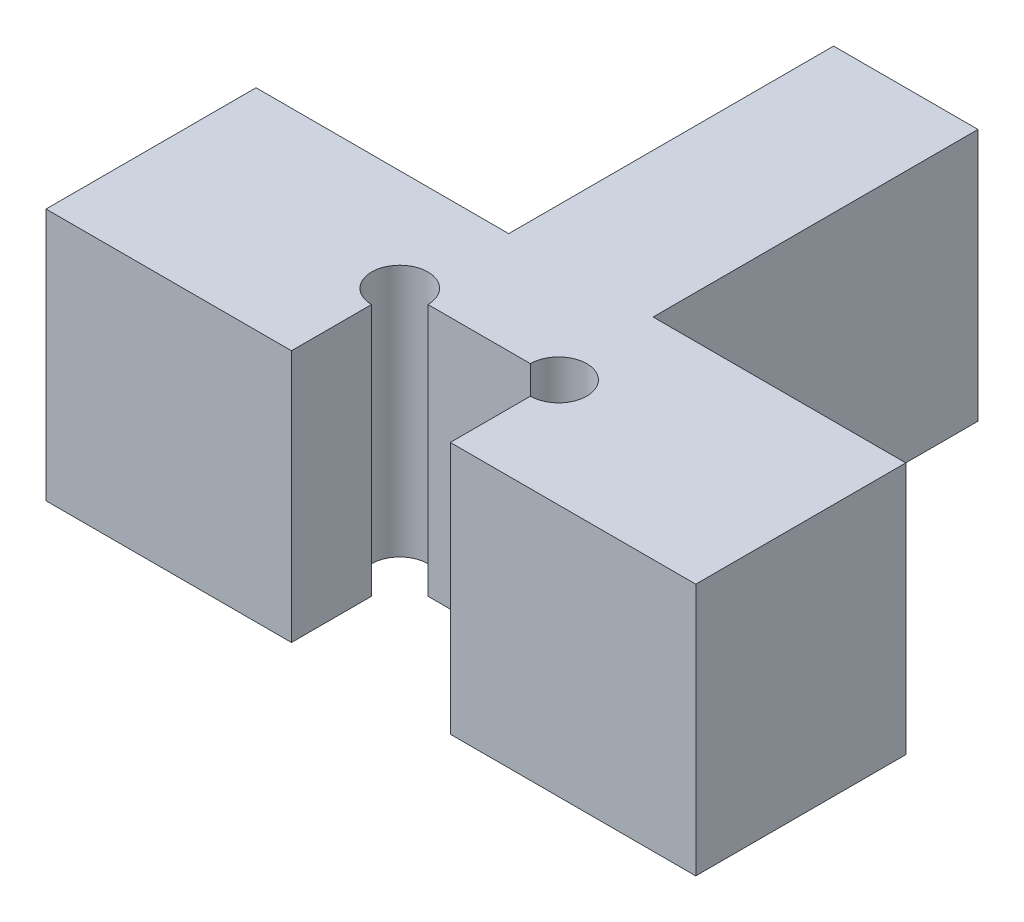
ISO-10303-21;
HEADER;
FILE_DESCRIPTION(('STEP AP214'),'2;1');
FILE_NAME('part.step','',(''),(''),'','','');
FILE_SCHEMA(('AUTOMOTIVE_DESIGN { 1 0 10303 214 1 1 1 1 }'));
ENDSEC;
DATA;
#1=APPLICATION_CONTEXT('core data for automotive mechanical design processes');
#2=APPLICATION_PROTOCOL_DEFINITION('international standard','automotive_design',2000,#1);
#3=PRODUCT_CONTEXT('',#1,'mechanical');
#4=PRODUCT('Part','Part','',(#3));
#5=PRODUCT_RELATED_PRODUCT_CATEGORY('part','',(#4));
#6=PRODUCT_DEFINITION_FORMATION('','',#4);
#7=PRODUCT_DEFINITION_CONTEXT('part definition',#1,'design');
#8=PRODUCT_DEFINITION('design','',#6,#7);
#9=PRODUCT_DEFINITION_SHAPE('','',#8);
#10=(LENGTH_UNIT() NAMED_UNIT(*) SI_UNIT(.MILLI.,.METRE.));
#11=(NAMED_UNIT(*) PLANE_ANGLE_UNIT() SI_UNIT($,.RADIAN.));
#12=(NAMED_UNIT(*) SI_UNIT($,.STERADIAN.) SOLID_ANGLE_UNIT());
#13=UNCERTAINTY_MEASURE_WITH_UNIT(LENGTH_MEASURE(1.E-05),#10,'distance_accuracy_value','');
#14=(GEOMETRIC_REPRESENTATION_CONTEXT(3) GLOBAL_UNCERTAINTY_ASSIGNED_CONTEXT((#13)) GLOBAL_UNIT_ASSIGNED_CONTEXT((#10,
#11,#12)) REPRESENTATION_CONTEXT('',''));
#15=CARTESIAN_POINT('',(0.,0.,0.));
#16=DIRECTION('',(0.,0.,1.));
#17=DIRECTION('',(1.,0.,0.));
#18=AXIS2_PLACEMENT_3D('',#15,#16,#17);
#19=CARTESIAN_POINT('',(-0.999999999999825,3.5,-7.24500456035712));
#20=DIRECTION('',(1.,0.,0.));
#21=DIRECTION('',(0.,0.,-1.));
#22=AXIS2_PLACEMENT_3D('',#19,#20,#21);
#23=PLANE('',#22);
#24=DIRECTION('',(0.,0.,1.));
#25=VECTOR('',#24,1.);
#26=CARTESIAN_POINT('',(-0.999999999999825,0.,-7.24500456035712));
#27=LINE('',#26,#25);
#28=CARTESIAN_POINT('',(-0.999999999999825,0.,-7.24500456035712));
#29=VERTEX_POINT('',#28);
#30=CARTESIAN_POINT('',(-0.999999999999824,0.,-2.74500456035711));
#31=VERTEX_POINT('',#30);
#32=EDGE_CURVE('E165',#29,#31,#27,.T.);
#33=ORIENTED_EDGE('',*,*,#32,.T.);
#34=DIRECTION('',(0.,-1.,0.));
#35=VECTOR('',#34,1.);
#36=CARTESIAN_POINT('',(-0.999999999999824,3.5,-2.74500456035711));
#37=LINE('',#36,#35);
#38=CARTESIAN_POINT('',(-0.999999999999824,3.5,-2.74500456035711));
#39=VERTEX_POINT('',#38);
#40=EDGE_CURVE('E11',#39,#31,#37,.T.);
#41=ORIENTED_EDGE('',*,*,#40,.F.);
#42=DIRECTION('',(0.,0.,1.));
#43=VECTOR('',#42,1.);
#44=CARTESIAN_POINT('',(-0.999999999999825,3.5,-7.24500456035712));
#45=LINE('',#44,#43);
#46=CARTESIAN_POINT('',(-0.999999999999825,3.5,-7.24500456035712));
#47=VERTEX_POINT('',#46);
#48=EDGE_CURVE('E196',#47,#39,#45,.T.);
#49=ORIENTED_EDGE('',*,*,#48,.F.);
#50=DIRECTION('',(0.,-1.,0.));
#51=VECTOR('',#50,1.);
#52=CARTESIAN_POINT('',(-0.999999999999825,3.5,-7.24500456035712));
#53=LINE('',#52,#51);
#54=EDGE_CURVE('E161',#47,#29,#53,.T.);
#55=ORIENTED_EDGE('',*,*,#54,.T.);
#56=EDGE_LOOP('',(#33,#41,#49,#55));
#57=FACE_BOUND('',#56,.T.);
#58=ADVANCED_FACE('F33',(#57),#23,.F.);
#59=CARTESIAN_POINT('',(-0.999999999999824,3.5,-2.74500456035711));
#60=DIRECTION('',(0.,0.,1.));
#61=DIRECTION('',(1.,0.,0.));
#62=AXIS2_PLACEMENT_3D('',#59,#60,#61);
#63=PLANE('',#62);
#64=DIRECTION('',(-1.,0.,0.));
#65=VECTOR('',#64,1.);
#66=CARTESIAN_POINT('',(-0.999999999999824,0.,-2.74500456035711));
#67=LINE('',#66,#65);
#68=CARTESIAN_POINT('',(-4.49999999999982,0.,-2.74500456035711));
#69=VERTEX_POINT('',#68);
#70=EDGE_CURVE('E168',#31,#69,#67,.T.);
#71=ORIENTED_EDGE('',*,*,#70,.T.);
#72=DIRECTION('',(0.,-1.,0.));
#73=VECTOR('',#72,1.);
#74=CARTESIAN_POINT('',(-4.49999999999982,3.5,-2.74500456035711));
#75=LINE('',#74,#73);
#76=CARTESIAN_POINT('',(-4.49999999999982,3.5,-2.74500456035711));
#77=VERTEX_POINT('',#76);
#78=EDGE_CURVE('E41',#77,#69,#75,.T.);
#79=ORIENTED_EDGE('',*,*,#78,.F.);
#80=DIRECTION('',(-1.,0.,0.));
#81=VECTOR('',#80,1.);
#82=CARTESIAN_POINT('',(-0.999999999999824,3.5,-2.74500456035711));
#83=LINE('',#82,#81);
#84=EDGE_CURVE('E110',#39,#77,#83,.T.);
#85=ORIENTED_EDGE('',*,*,#84,.F.);
#86=ORIENTED_EDGE('',*,*,#40,.T.);
#87=EDGE_LOOP('',(#71,#79,#85,#86));
#88=FACE_BOUND('',#87,.T.);
#89=ADVANCED_FACE('F281',(#88),#63,.F.);
#90=CARTESIAN_POINT('',(-4.49999999999982,3.5,-2.74500456035711));
#91=DIRECTION('',(1.,0.,0.));
#92=DIRECTION('',(0.,0.,-1.));
#93=AXIS2_PLACEMENT_3D('',#90,#91,#92);
#94=PLANE('',#93);
#95=DIRECTION('',(0.,0.,1.));
#96=VECTOR('',#95,1.);
#97=CARTESIAN_POINT('',(-4.49999999999982,0.,-2.74500456035711));
#98=LINE('',#97,#96);
#99=CARTESIAN_POINT('',(-4.49999999999982,0.,0.164245439642922));
#100=VERTEX_POINT('',#99);
#101=EDGE_CURVE('E170',#69,#100,#98,.T.);
#102=ORIENTED_EDGE('',*,*,#101,.T.);
#103=DIRECTION('',(0.,-1.,0.));
#104=VECTOR('',#103,1.);
#105=CARTESIAN_POINT('',(-4.49999999999982,3.5,0.164245439642922));
#106=LINE('',#105,#104);
#107=CARTESIAN_POINT('',(-4.49999999999982,3.5,0.164245439642922));
#108=VERTEX_POINT('',#107);
#109=EDGE_CURVE('E216',#108,#100,#106,.T.);
#110=ORIENTED_EDGE('',*,*,#109,.F.);
#111=DIRECTION('',(0.,0.,1.));
#112=VECTOR('',#111,1.);
#113=CARTESIAN_POINT('',(-4.49999999999982,3.5,-2.74500456035711));
#114=LINE('',#113,#112);
#115=EDGE_CURVE('E224',#77,#108,#114,.T.);
#116=ORIENTED_EDGE('',*,*,#115,.F.);
#117=ORIENTED_EDGE('',*,*,#78,.T.);
#118=EDGE_LOOP('',(#102,#110,#116,#117));
#119=FACE_BOUND('',#118,.T.);
#120=ADVANCED_FACE('F222',(#119),#94,.F.);
#121=CARTESIAN_POINT('',(-4.49999999999982,3.5,0.164245439642922));
#122=DIRECTION('',(0.,0.,-1.));
#123=DIRECTION('',(-1.,0.,0.));
#124=AXIS2_PLACEMENT_3D('',#121,#122,#123);
#125=PLANE('',#124);
#126=DIRECTION('',(1.,0.,0.));
#127=VECTOR('',#126,1.);
#128=CARTESIAN_POINT('',(-4.49999999999982,0.,0.164245439642922));
#129=LINE('',#128,#127);
#130=CARTESIAN_POINT('',(-1.09999999999983,0.,0.164245439642922));
#131=VERTEX_POINT('',#130);
#132=EDGE_CURVE('E172',#100,#131,#129,.T.);
#133=ORIENTED_EDGE('',*,*,#132,.T.);
#134=DIRECTION('',(0.,-1.,0.));
#135=VECTOR('',#134,1.);
#136=CARTESIAN_POINT('',(-1.09999999999983,3.5,0.164245439642922));
#137=LINE('',#136,#135);
#138=CARTESIAN_POINT('',(-1.09999999999983,3.5,0.164245439642922));
#139=VERTEX_POINT('',#138);
#140=EDGE_CURVE('E213',#139,#131,#137,.T.);
#141=ORIENTED_EDGE('',*,*,#140,.F.);
#142=DIRECTION('',(1.,0.,0.));
#143=VECTOR('',#142,1.);
#144=CARTESIAN_POINT('',(-4.49999999999982,3.5,0.164245439642922));
#145=LINE('',#144,#143);
#146=EDGE_CURVE('E242',#108,#139,#145,.T.);
#147=ORIENTED_EDGE('',*,*,#146,.F.);
#148=ORIENTED_EDGE('',*,*,#109,.T.);
#149=EDGE_LOOP('',(#133,#141,#147,#148));
#150=FACE_BOUND('',#149,.T.);
#151=ADVANCED_FACE('F232',(#150),#125,.F.);
#152=CARTESIAN_POINT('',(-1.09999999999983,3.5,0.164245439642922));
#153=DIRECTION('',(-1.,0.,0.));
#154=DIRECTION('',(0.,0.,1.));
#155=AXIS2_PLACEMENT_3D('',#152,#153,#154);
#156=PLANE('',#155);
#157=DIRECTION('',(0.,0.,-1.));
#158=VECTOR('',#157,1.);
#159=CARTESIAN_POINT('',(-1.09999999999983,0.,0.164245439642922));
#160=LINE('',#159,#158);
#161=CARTESIAN_POINT('',(-1.09999999999983,0.,-0.94535974729461));
#162=VERTEX_POINT('',#161);
#163=EDGE_CURVE('E174',#131,#162,#160,.T.);
#164=ORIENTED_EDGE('',*,*,#163,.T.);
#165=DIRECTION('',(0.,-1.,0.));
#166=VECTOR('',#165,1.);
#167=CARTESIAN_POINT('',(-1.09999999999983,3.5,-0.94535974729461));
#168=LINE('',#167,#166);
#169=CARTESIAN_POINT('',(-1.09999999999983,3.5,-0.94535974729461));
#170=VERTEX_POINT('',#169);
#171=EDGE_CURVE('E211',#170,#162,#168,.T.);
#172=ORIENTED_EDGE('',*,*,#171,.F.);
#173=DIRECTION('',(0.,0.,-1.));
#174=VECTOR('',#173,1.);
#175=CARTESIAN_POINT('',(-1.09999999999983,3.5,0.164245439642922));
#176=LINE('',#175,#174);
#177=EDGE_CURVE('E238',#139,#170,#176,.T.);
#178=ORIENTED_EDGE('',*,*,#177,.F.);
#179=ORIENTED_EDGE('',*,*,#140,.T.);
#180=EDGE_LOOP('',(#164,#172,#178,#179));
#181=FACE_BOUND('',#180,.T.);
#182=ADVANCED_FACE('F236',(#181),#156,.F.);
#183=CARTESIAN_POINT('',(-1.09999999999983,3.5,-1.33575456035708));
#184=DIRECTION('',(0.,-1.,0.));
#185=DIRECTION('',(0.,0.,-1.));
#186=AXIS2_PLACEMENT_3D('',#183,#184,#185);
#187=CYLINDRICAL_SURFACE('',#186,0.390394813062468);
#188=CARTESIAN_POINT('',(-1.09999999999983,0.,-1.33575456035708));
#189=DIRECTION('',(0.,1.,0.));
#190=DIRECTION('',(0.,0.,1.));
#191=AXIS2_PLACEMENT_3D('',#188,#189,#190);
#192=CIRCLE('',#191,0.390394813062468);
#193=CARTESIAN_POINT('',(-0.709605186937366,0.,-1.33575456035713));
#194=VERTEX_POINT('',#193);
#195=EDGE_CURVE('E177',#194,#162,#192,.T.);
#196=ORIENTED_EDGE('',*,*,#195,.F.);
#197=DIRECTION('',(0.,-1.,0.));
#198=VECTOR('',#197,1.);
#199=CARTESIAN_POINT('',(-0.709605186937366,3.5,-1.33575456035713));
#200=LINE('',#199,#198);
#201=CARTESIAN_POINT('',(-0.709605186937366,3.5,-1.33575456035713));
#202=VERTEX_POINT('',#201);
#203=EDGE_CURVE('E209',#202,#194,#200,.T.);
#204=ORIENTED_EDGE('',*,*,#203,.F.);
#205=CARTESIAN_POINT('',(-1.09999999999983,3.5,-1.33575456035708));
#206=DIRECTION('',(0.,1.,0.));
#207=DIRECTION('',(0.,0.,1.));
#208=AXIS2_PLACEMENT_3D('',#205,#206,#207);
#209=CIRCLE('',#208,0.390394813062468);
#210=EDGE_CURVE('E241',#202,#170,#209,.T.);
#211=ORIENTED_EDGE('',*,*,#210,.T.);
#212=ORIENTED_EDGE('',*,*,#171,.T.);
#213=EDGE_LOOP('',(#196,#204,#211,#212));
#214=FACE_BOUND('',#213,.T.);
#215=ADVANCED_FACE('F294',(#214),#187,.F.);
#216=CARTESIAN_POINT('',(-0.709605186937366,3.5,-1.33575456035713));
#217=DIRECTION('',(0.,0.,-1.));
#218=DIRECTION('',(-1.,0.,0.));
#219=AXIS2_PLACEMENT_3D('',#216,#217,#218);
#220=PLANE('',#219);
#221=DIRECTION('',(1.,0.,0.));
#222=VECTOR('',#221,1.);
#223=CARTESIAN_POINT('',(-0.709605186937366,0.,-1.33575456035713));
#224=LINE('',#223,#222);
#225=CARTESIAN_POINT('',(0.70960518693754,0.,-1.33575456035717));
#226=VERTEX_POINT('',#225);
#227=EDGE_CURVE('E180',#194,#226,#224,.T.);
#228=ORIENTED_EDGE('',*,*,#227,.T.);
#229=DIRECTION('',(0.,-1.,0.));
#230=VECTOR('',#229,1.);
#231=CARTESIAN_POINT('',(0.70960518693754,3.5,-1.33575456035717));
#232=LINE('',#231,#230);
#233=CARTESIAN_POINT('',(0.70960518693754,3.5,-1.33575456035717));
#234=VERTEX_POINT('',#233);
#235=EDGE_CURVE('E207',#234,#226,#232,.T.);
#236=ORIENTED_EDGE('',*,*,#235,.F.);
#237=DIRECTION('',(1.,0.,0.));
#238=VECTOR('',#237,1.);
#239=CARTESIAN_POINT('',(-0.709605186937366,3.5,-1.33575456035713));
#240=LINE('',#239,#238);
#241=EDGE_CURVE('E244',#202,#234,#240,.T.);
#242=ORIENTED_EDGE('',*,*,#241,.F.);
#243=ORIENTED_EDGE('',*,*,#203,.T.);
#244=EDGE_LOOP('',(#228,#236,#242,#243));
#245=FACE_BOUND('',#244,.T.);
#246=ADVANCED_FACE('F297',(#245),#220,.F.);
#247=CARTESIAN_POINT('',(1.10000000000001,3.5,-1.33575456035717));
#248=DIRECTION('',(0.,-1.,0.));
#249=DIRECTION('',(0.,0.,-1.));
#250=AXIS2_PLACEMENT_3D('',#247,#248,#249);
#251=CYLINDRICAL_SURFACE('',#250,0.390394813062468);
#252=CARTESIAN_POINT('',(1.10000000000001,0.,-1.33575456035717));
#253=DIRECTION('',(0.,1.,0.));
#254=DIRECTION('',(0.,0.,1.));
#255=AXIS2_PLACEMENT_3D('',#252,#253,#254);
#256=CIRCLE('',#255,0.390394813062468);
#257=CARTESIAN_POINT('',(1.10000000000018,0.,-0.945359747294701));
#258=VERTEX_POINT('',#257);
#259=EDGE_CURVE('E183',#258,#226,#256,.T.);
#260=ORIENTED_EDGE('',*,*,#259,.F.);
#261=DIRECTION('',(0.,-1.,0.));
#262=VECTOR('',#261,1.);
#263=CARTESIAN_POINT('',(1.10000000000018,3.5,-0.945359747294701));
#264=LINE('',#263,#262);
#265=CARTESIAN_POINT('',(1.10000000000018,3.5,-0.945359747294701));
#266=VERTEX_POINT('',#265);
#267=EDGE_CURVE('E205',#266,#258,#264,.T.);
#268=ORIENTED_EDGE('',*,*,#267,.F.);
#269=CARTESIAN_POINT('',(1.10000000000001,3.5,-1.33575456035717));
#270=DIRECTION('',(0.,1.,0.));
#271=DIRECTION('',(0.,0.,1.));
#272=AXIS2_PLACEMENT_3D('',#269,#270,#271);
#273=CIRCLE('',#272,0.390394813062468);
#274=EDGE_CURVE('E250',#266,#234,#273,.T.);
#275=ORIENTED_EDGE('',*,*,#274,.T.);
#276=ORIENTED_EDGE('',*,*,#235,.T.);
#277=EDGE_LOOP('',(#260,#268,#275,#276));
#278=FACE_BOUND('',#277,.T.);
#279=ADVANCED_FACE('F301',(#278),#251,.F.);
#280=CARTESIAN_POINT('',(1.10000000000018,3.5,0.164245439642922));
#281=DIRECTION('',(-1.,0.,0.));
#282=DIRECTION('',(0.,0.,1.));
#283=AXIS2_PLACEMENT_3D('',#280,#281,#282);
#284=PLANE('',#283);
#285=DIRECTION('',(0.,0.,-1.));
#286=VECTOR('',#285,1.);
#287=CARTESIAN_POINT('',(1.10000000000018,0.,0.164245439642922));
#288=LINE('',#287,#286);
#289=CARTESIAN_POINT('',(1.10000000000018,0.,0.164245439642922));
#290=VERTEX_POINT('',#289);
#291=EDGE_CURVE('E186',#290,#258,#288,.T.);
#292=ORIENTED_EDGE('',*,*,#291,.F.);
#293=DIRECTION('',(0.,-1.,0.));
#294=VECTOR('',#293,1.);
#295=CARTESIAN_POINT('',(1.10000000000018,3.5,0.164245439642922));
#296=LINE('',#295,#294);
#297=CARTESIAN_POINT('',(1.10000000000018,3.5,0.164245439642922));
#298=VERTEX_POINT('',#297);
#299=EDGE_CURVE('E203',#298,#290,#296,.T.);
#300=ORIENTED_EDGE('',*,*,#299,.F.);
#301=DIRECTION('',(0.,0.,-1.));
#302=VECTOR('',#301,1.);
#303=CARTESIAN_POINT('',(1.10000000000018,3.5,0.164245439642922));
#304=LINE('',#303,#302);
#305=EDGE_CURVE('E253',#298,#266,#304,.T.);
#306=ORIENTED_EDGE('',*,*,#305,.T.);
#307=ORIENTED_EDGE('',*,*,#267,.T.);
#308=EDGE_LOOP('',(#292,#300,#306,#307));
#309=FACE_BOUND('',#308,.T.);
#310=ADVANCED_FACE('F305',(#309),#284,.T.);
#311=CARTESIAN_POINT('',(1.10000000000018,3.5,0.164245439642922));
#312=DIRECTION('',(0.,0.,-1.));
#313=DIRECTION('',(-1.,0.,0.));
#314=AXIS2_PLACEMENT_3D('',#311,#312,#313);
#315=PLANE('',#314);
#316=DIRECTION('',(1.,0.,0.));
#317=VECTOR('',#316,1.);
#318=CARTESIAN_POINT('',(1.10000000000018,0.,0.164245439642922));
#319=LINE('',#318,#317);
#320=CARTESIAN_POINT('',(4.49999999999982,0.,0.164245439642922));
#321=VERTEX_POINT('',#320);
#322=EDGE_CURVE('E189',#290,#321,#319,.T.);
#323=ORIENTED_EDGE('',*,*,#322,.T.);
#324=DIRECTION('',(0.,-1.,0.));
#325=VECTOR('',#324,1.);
#326=CARTESIAN_POINT('',(4.49999999999982,3.5,0.164245439642922));
#327=LINE('',#326,#325);
#328=CARTESIAN_POINT('',(4.49999999999982,3.5,0.164245439642922));
#329=VERTEX_POINT('',#328);
#330=EDGE_CURVE('E200',#329,#321,#327,.T.);
#331=ORIENTED_EDGE('',*,*,#330,.F.);
#332=DIRECTION('',(1.,0.,0.));
#333=VECTOR('',#332,1.);
#334=CARTESIAN_POINT('',(1.10000000000018,3.5,0.164245439642922));
#335=LINE('',#334,#333);
#336=EDGE_CURVE('E256',#298,#329,#335,.T.);
#337=ORIENTED_EDGE('',*,*,#336,.F.);
#338=ORIENTED_EDGE('',*,*,#299,.T.);
#339=EDGE_LOOP('',(#323,#331,#337,#338));
#340=FACE_BOUND('',#339,.T.);
#341=ADVANCED_FACE('F262',(#340),#315,.F.);
#342=CARTESIAN_POINT('',(4.49999999999982,3.5,0.164245439642922));
#343=DIRECTION('',(-1.,0.,0.));
#344=DIRECTION('',(0.,0.,1.));
#345=AXIS2_PLACEMENT_3D('',#342,#343,#344);
#346=PLANE('',#345);
#347=DIRECTION('',(0.,0.,-1.));
#348=VECTOR('',#347,1.);
#349=CARTESIAN_POINT('',(4.49999999999982,0.,0.164245439642922));
#350=LINE('',#349,#348);
#351=CARTESIAN_POINT('',(4.49999999999982,0.,-2.74500456035711));
#352=VERTEX_POINT('',#351);
#353=EDGE_CURVE('E191',#321,#352,#350,.T.);
#354=ORIENTED_EDGE('',*,*,#353,.T.);
#355=DIRECTION('',(0.,-1.,0.));
#356=VECTOR('',#355,1.);
#357=CARTESIAN_POINT('',(4.49999999999982,3.5,-2.74500456035711));
#358=LINE('',#357,#356);
#359=CARTESIAN_POINT('',(4.49999999999982,3.5,-2.74500456035711));
#360=VERTEX_POINT('',#359);
#361=EDGE_CURVE('E156',#360,#352,#358,.T.);
#362=ORIENTED_EDGE('',*,*,#361,.F.);
#363=DIRECTION('',(0.,0.,-1.));
#364=VECTOR('',#363,1.);
#365=CARTESIAN_POINT('',(4.49999999999982,3.5,0.164245439642922));
#366=LINE('',#365,#364);
#367=EDGE_CURVE('E147',#329,#360,#366,.T.);
#368=ORIENTED_EDGE('',*,*,#367,.F.);
#369=ORIENTED_EDGE('',*,*,#330,.T.);
#370=EDGE_LOOP('',(#354,#362,#368,#369));
#371=FACE_BOUND('',#370,.T.);
#372=ADVANCED_FACE('F266',(#371),#346,.F.);
#373=CARTESIAN_POINT('',(4.49999999999982,3.5,-2.74500456035711));
#374=DIRECTION('',(0.,0.,1.));
#375=DIRECTION('',(1.,0.,0.));
#376=AXIS2_PLACEMENT_3D('',#373,#374,#375);
#377=PLANE('',#376);
#378=DIRECTION('',(-1.,0.,0.));
#379=VECTOR('',#378,1.);
#380=CARTESIAN_POINT('',(4.49999999999982,0.,-2.74500456035711));
#381=LINE('',#380,#379);
#382=CARTESIAN_POINT('',(0.999999999999824,0.,-2.74500456035711));
#383=VERTEX_POINT('',#382);
#384=EDGE_CURVE('E155',#352,#383,#381,.T.);
#385=ORIENTED_EDGE('',*,*,#384,.T.);
#386=DIRECTION('',(0.,-1.,0.));
#387=VECTOR('',#386,1.);
#388=CARTESIAN_POINT('',(0.999999999999824,3.5,-2.74500456035711));
#389=LINE('',#388,#387);
#390=CARTESIAN_POINT('',(0.999999999999824,3.5,-2.74500456035711));
#391=VERTEX_POINT('',#390);
#392=EDGE_CURVE('E152',#391,#383,#389,.T.);
#393=ORIENTED_EDGE('',*,*,#392,.F.);
#394=DIRECTION('',(-1.,0.,0.));
#395=VECTOR('',#394,1.);
#396=CARTESIAN_POINT('',(4.49999999999982,3.5,-2.74500456035711));
#397=LINE('',#396,#395);
#398=EDGE_CURVE('E141',#360,#391,#397,.T.);
#399=ORIENTED_EDGE('',*,*,#398,.F.);
#400=ORIENTED_EDGE('',*,*,#361,.T.);
#401=EDGE_LOOP('',(#385,#393,#399,#400));
#402=FACE_BOUND('',#401,.T.);
#403=ADVANCED_FACE('F153',(#402),#377,.F.);
#404=CARTESIAN_POINT('',(0.999999999999824,3.5,-2.74500456035711));
#405=DIRECTION('',(-1.,0.,0.));
#406=DIRECTION('',(0.,0.,1.));
#407=AXIS2_PLACEMENT_3D('',#404,#405,#406);
#408=PLANE('',#407);
#409=DIRECTION('',(0.,0.,-1.));
#410=VECTOR('',#409,1.);
#411=CARTESIAN_POINT('',(0.999999999999824,0.,-2.74500456035711));
#412=LINE('',#411,#410);
#413=CARTESIAN_POINT('',(0.999999999999825,0.,-7.24500456035712));
#414=VERTEX_POINT('',#413);
#415=EDGE_CURVE('E96',#383,#414,#412,.T.);
#416=ORIENTED_EDGE('',*,*,#415,.T.);
#417=DIRECTION('',(0.,-1.,0.));
#418=VECTOR('',#417,1.);
#419=CARTESIAN_POINT('',(0.999999999999825,3.5,-7.24500456035712));
#420=LINE('',#419,#418);
#421=CARTESIAN_POINT('',(0.999999999999825,3.5,-7.24500456035712));
#422=VERTEX_POINT('',#421);
#423=EDGE_CURVE('E157',#422,#414,#420,.T.);
#424=ORIENTED_EDGE('',*,*,#423,.F.);
#425=DIRECTION('',(0.,0.,-1.));
#426=VECTOR('',#425,1.);
#427=CARTESIAN_POINT('',(0.999999999999824,3.5,-2.74500456035711));
#428=LINE('',#427,#426);
#429=EDGE_CURVE('E145',#391,#422,#428,.T.);
#430=ORIENTED_EDGE('',*,*,#429,.F.);
#431=ORIENTED_EDGE('',*,*,#392,.T.);
#432=EDGE_LOOP('',(#416,#424,#430,#431));
#433=FACE_BOUND('',#432,.T.);
#434=ADVANCED_FACE('F159',(#433),#408,.F.);
#435=CARTESIAN_POINT('',(0.999999999999825,3.5,-7.24500456035712));
#436=DIRECTION('',(0.,0.,1.));
#437=DIRECTION('',(1.,0.,0.));
#438=AXIS2_PLACEMENT_3D('',#435,#436,#437);
#439=PLANE('',#438);
#440=DIRECTION('',(-1.,0.,0.));
#441=VECTOR('',#440,1.);
#442=CARTESIAN_POINT('',(0.999999999999825,0.,-7.24500456035712));
#443=LINE('',#442,#441);
#444=EDGE_CURVE('E102',#414,#29,#443,.T.);
#445=ORIENTED_EDGE('',*,*,#444,.T.);
#446=ORIENTED_EDGE('',*,*,#54,.F.);
#447=DIRECTION('',(-1.,0.,0.));
#448=VECTOR('',#447,1.);
#449=CARTESIAN_POINT('',(0.999999999999825,3.5,-7.24500456035712));
#450=LINE('',#449,#448);
#451=EDGE_CURVE('E49',#422,#47,#450,.T.);
#452=ORIENTED_EDGE('',*,*,#451,.F.);
#453=ORIENTED_EDGE('',*,*,#423,.T.);
#454=EDGE_LOOP('',(#445,#446,#452,#453));
#455=FACE_BOUND('',#454,.T.);
#456=ADVANCED_FACE('F270',(#455),#439,.F.);
#457=CARTESIAN_POINT('',(-1.09999999999983,3.5,-1.33575456035708));
#458=DIRECTION('',(0.,1.,0.));
#459=DIRECTION('',(0.,0.,1.));
#460=AXIS2_PLACEMENT_3D('',#457,#458,#459);
#461=PLANE('',#460);
#462=ORIENTED_EDGE('',*,*,#48,.T.);
#463=ORIENTED_EDGE('',*,*,#84,.T.);
#464=ORIENTED_EDGE('',*,*,#115,.T.);
#465=ORIENTED_EDGE('',*,*,#146,.T.);
#466=ORIENTED_EDGE('',*,*,#177,.T.);
#467=ORIENTED_EDGE('',*,*,#210,.F.);
#468=ORIENTED_EDGE('',*,*,#241,.T.);
#469=ORIENTED_EDGE('',*,*,#274,.F.);
#470=ORIENTED_EDGE('',*,*,#305,.F.);
#471=ORIENTED_EDGE('',*,*,#336,.T.);
#472=ORIENTED_EDGE('',*,*,#367,.T.);
#473=ORIENTED_EDGE('',*,*,#398,.T.);
#474=ORIENTED_EDGE('',*,*,#429,.T.);
#475=ORIENTED_EDGE('',*,*,#451,.T.);
#476=EDGE_LOOP('',(#462,#463,#464,#465,#466,#467,#468,#469,#470,#471,#472,#473,#474,#475));
#477=FACE_BOUND('',#476,.T.);
#478=ADVANCED_FACE('F143',(#477),#461,.T.);
#479=CARTESIAN_POINT('',(-1.09999999999983,0.,-1.33575456035708));
#480=DIRECTION('',(0.,1.,0.));
#481=DIRECTION('',(0.,0.,1.));
#482=AXIS2_PLACEMENT_3D('',#479,#480,#481);
#483=PLANE('',#482);
#484=ORIENTED_EDGE('',*,*,#32,.F.);
#485=ORIENTED_EDGE('',*,*,#444,.F.);
#486=ORIENTED_EDGE('',*,*,#415,.F.);
#487=ORIENTED_EDGE('',*,*,#384,.F.);
#488=ORIENTED_EDGE('',*,*,#353,.F.);
#489=ORIENTED_EDGE('',*,*,#322,.F.);
#490=ORIENTED_EDGE('',*,*,#291,.T.);
#491=ORIENTED_EDGE('',*,*,#259,.T.);
#492=ORIENTED_EDGE('',*,*,#227,.F.);
#493=ORIENTED_EDGE('',*,*,#195,.T.);
#494=ORIENTED_EDGE('',*,*,#163,.F.);
#495=ORIENTED_EDGE('',*,*,#132,.F.);
#496=ORIENTED_EDGE('',*,*,#101,.F.);
#497=ORIENTED_EDGE('',*,*,#70,.F.);
#498=EDGE_LOOP('',(#484,#485,#486,#487,#488,#489,#490,#491,#492,#493,#494,#495,#496,#497));
#499=FACE_BOUND('',#498,.T.);
#500=ADVANCED_FACE('F228',(#499),#483,.F.);
#501=CLOSED_SHELL('',(#58,#89,#120,#151,#182,#215,#246,#279,#310,#341,#372,#403,#434,#456,#478,#500));
#502=MANIFOLD_SOLID_BREP('B2',#501);
#503=ADVANCED_BREP_SHAPE_REPRESENTATION('',(#18,#502),#14);
#504=SHAPE_DEFINITION_REPRESENTATION(#9,#503);
ENDSEC;
END-ISO-10303-21;
